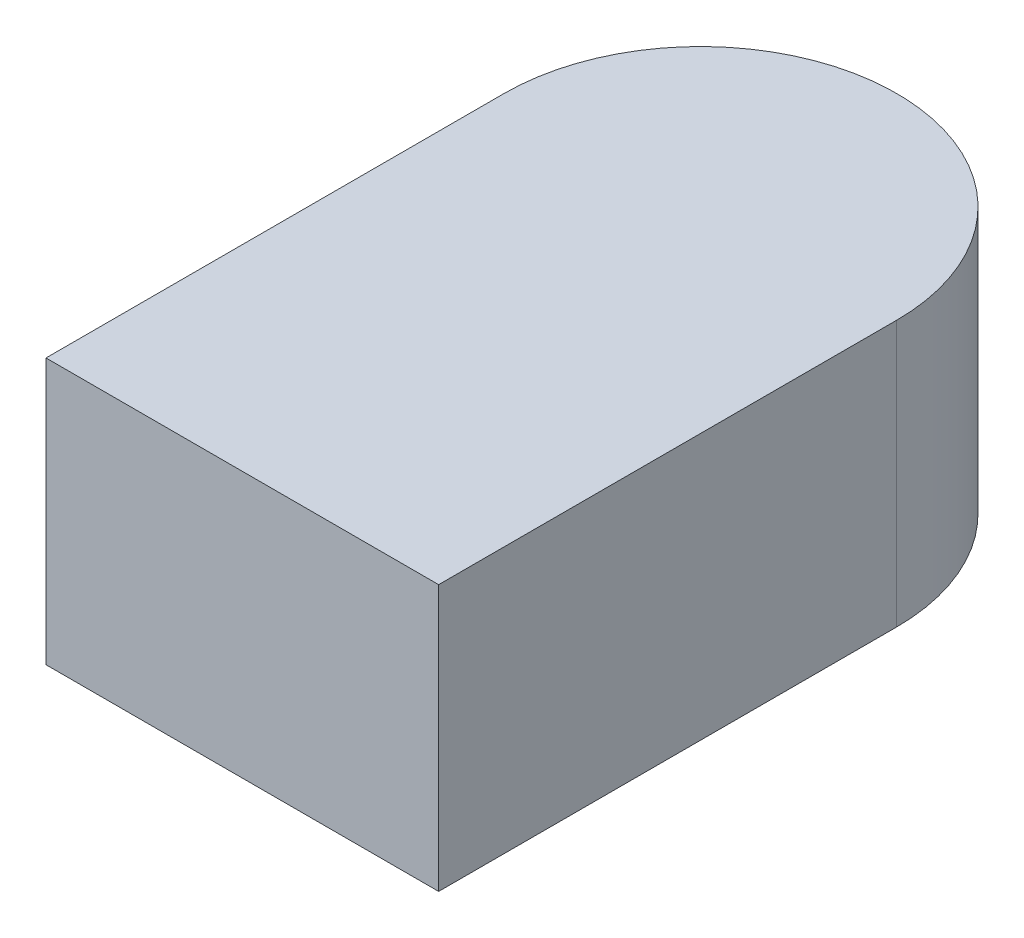
ISO-10303-21;
HEADER;
FILE_DESCRIPTION(('STEP AP214'),'2;1');
FILE_NAME('part.step','',(''),(''),'','','');
FILE_SCHEMA(('AUTOMOTIVE_DESIGN { 1 0 10303 214 1 1 1 1 }'));
ENDSEC;
DATA;
#1=APPLICATION_CONTEXT('core data for automotive mechanical design processes');
#2=APPLICATION_PROTOCOL_DEFINITION('international standard','automotive_design',2000,#1);
#3=PRODUCT_CONTEXT('',#1,'mechanical');
#4=PRODUCT('Part','Part','',(#3));
#5=PRODUCT_RELATED_PRODUCT_CATEGORY('part','',(#4));
#6=PRODUCT_DEFINITION_FORMATION('','',#4);
#7=PRODUCT_DEFINITION_CONTEXT('part definition',#1,'design');
#8=PRODUCT_DEFINITION('design','',#6,#7);
#9=PRODUCT_DEFINITION_SHAPE('','',#8);
#10=(LENGTH_UNIT() NAMED_UNIT(*) SI_UNIT(.MILLI.,.METRE.));
#11=(NAMED_UNIT(*) PLANE_ANGLE_UNIT() SI_UNIT($,.RADIAN.));
#12=(NAMED_UNIT(*) SI_UNIT($,.STERADIAN.) SOLID_ANGLE_UNIT());
#13=UNCERTAINTY_MEASURE_WITH_UNIT(LENGTH_MEASURE(1.E-05),#10,'distance_accuracy_value','');
#14=(GEOMETRIC_REPRESENTATION_CONTEXT(3) GLOBAL_UNCERTAINTY_ASSIGNED_CONTEXT((#13)) GLOBAL_UNIT_ASSIGNED_CONTEXT((#10,
#11,#12)) REPRESENTATION_CONTEXT('',''));
#15=CARTESIAN_POINT('',(0.,0.,0.));
#16=DIRECTION('',(0.,0.,1.));
#17=DIRECTION('',(1.,0.,0.));
#18=AXIS2_PLACEMENT_3D('',#15,#16,#17);
#19=CARTESIAN_POINT('',(0.15,0.203,-0.175));
#20=DIRECTION('',(-1.,0.,0.));
#21=DIRECTION('',(0.,0.,1.));
#22=AXIS2_PLACEMENT_3D('',#19,#20,#21);
#23=PLANE('',#22);
#24=DIRECTION('',(0.,0.,-1.));
#25=VECTOR('',#24,1.);
#26=CARTESIAN_POINT('',(0.15,0.,-0.175));
#27=LINE('',#26,#25);
#28=CARTESIAN_POINT('',(0.15,0.,0.175));
#29=VERTEX_POINT('',#28);
#30=CARTESIAN_POINT('',(0.15,0.,-0.175));
#31=VERTEX_POINT('',#30);
#32=EDGE_CURVE('E106',#29,#31,#27,.T.);
#33=ORIENTED_EDGE('',*,*,#32,.T.);
#34=DIRECTION('',(0.,-1.,0.));
#35=VECTOR('',#34,1.);
#36=CARTESIAN_POINT('',(0.15,0.203,-0.175));
#37=LINE('',#36,#35);
#38=CARTESIAN_POINT('',(0.15,0.203,-0.175));
#39=VERTEX_POINT('',#38);
#40=EDGE_CURVE('E11',#39,#31,#37,.T.);
#41=ORIENTED_EDGE('',*,*,#40,.F.);
#42=DIRECTION('',(0.,0.,-1.));
#43=VECTOR('',#42,1.);
#44=CARTESIAN_POINT('',(0.15,0.203,-0.175));
#45=LINE('',#44,#43);
#46=CARTESIAN_POINT('',(0.15,0.203,0.175));
#47=VERTEX_POINT('',#46);
#48=EDGE_CURVE('E88',#47,#39,#45,.T.);
#49=ORIENTED_EDGE('',*,*,#48,.F.);
#50=DIRECTION('',(0.,-1.,0.));
#51=VECTOR('',#50,1.);
#52=CARTESIAN_POINT('',(0.15,0.203,0.175));
#53=LINE('',#52,#51);
#54=EDGE_CURVE('E102',#47,#29,#53,.T.);
#55=ORIENTED_EDGE('',*,*,#54,.T.);
#56=EDGE_LOOP('',(#33,#41,#49,#55));
#57=FACE_BOUND('',#56,.T.);
#58=ADVANCED_FACE('F36',(#57),#23,.F.);
#59=CARTESIAN_POINT('',(0.,0.203,-0.175));
#60=DIRECTION('',(0.,-1.,0.));
#61=DIRECTION('',(0.,0.,-1.));
#62=AXIS2_PLACEMENT_3D('',#59,#60,#61);
#63=CYLINDRICAL_SURFACE('',#62,0.15);
#64=CARTESIAN_POINT('',(0.,0.,-0.175));
#65=DIRECTION('',(0.,1.,0.));
#66=DIRECTION('',(0.,0.,1.));
#67=AXIS2_PLACEMENT_3D('',#64,#65,#66);
#68=CIRCLE('',#67,0.15);
#69=CARTESIAN_POINT('',(-0.15,0.,-0.175));
#70=VERTEX_POINT('',#69);
#71=EDGE_CURVE('E93',#31,#70,#68,.T.);
#72=ORIENTED_EDGE('',*,*,#71,.T.);
#73=DIRECTION('',(0.,-1.,0.));
#74=VECTOR('',#73,1.);
#75=CARTESIAN_POINT('',(-0.15,0.203,-0.175));
#76=LINE('',#75,#74);
#77=CARTESIAN_POINT('',(-0.15,0.203,-0.175));
#78=VERTEX_POINT('',#77);
#79=EDGE_CURVE('E45',#78,#70,#76,.T.);
#80=ORIENTED_EDGE('',*,*,#79,.F.);
#81=CARTESIAN_POINT('',(0.,0.203,-0.175));
#82=DIRECTION('',(0.,1.,0.));
#83=DIRECTION('',(0.,0.,1.));
#84=AXIS2_PLACEMENT_3D('',#81,#82,#83);
#85=CIRCLE('',#84,0.15);
#86=EDGE_CURVE('E83',#39,#78,#85,.T.);
#87=ORIENTED_EDGE('',*,*,#86,.F.);
#88=ORIENTED_EDGE('',*,*,#40,.T.);
#89=EDGE_LOOP('',(#72,#80,#87,#88));
#90=FACE_BOUND('',#89,.T.);
#91=ADVANCED_FACE('F92',(#90),#63,.T.);
#92=CARTESIAN_POINT('',(-0.15,0.203,-0.175));
#93=DIRECTION('',(1.,0.,0.));
#94=DIRECTION('',(0.,0.,-1.));
#95=AXIS2_PLACEMENT_3D('',#92,#93,#94);
#96=PLANE('',#95);
#97=DIRECTION('',(0.,0.,1.));
#98=VECTOR('',#97,1.);
#99=CARTESIAN_POINT('',(-0.15,0.,-0.175));
#100=LINE('',#99,#98);
#101=CARTESIAN_POINT('',(-0.15,0.,0.175));
#102=VERTEX_POINT('',#101);
#103=EDGE_CURVE('E70',#70,#102,#100,.T.);
#104=ORIENTED_EDGE('',*,*,#103,.T.);
#105=DIRECTION('',(0.,-1.,0.));
#106=VECTOR('',#105,1.);
#107=CARTESIAN_POINT('',(-0.15,0.203,0.175));
#108=LINE('',#107,#106);
#109=CARTESIAN_POINT('',(-0.15,0.203,0.175));
#110=VERTEX_POINT('',#109);
#111=EDGE_CURVE('E95',#110,#102,#108,.T.);
#112=ORIENTED_EDGE('',*,*,#111,.F.);
#113=DIRECTION('',(0.,0.,1.));
#114=VECTOR('',#113,1.);
#115=CARTESIAN_POINT('',(-0.15,0.203,-0.175));
#116=LINE('',#115,#114);
#117=EDGE_CURVE('E86',#78,#110,#116,.T.);
#118=ORIENTED_EDGE('',*,*,#117,.F.);
#119=ORIENTED_EDGE('',*,*,#79,.T.);
#120=EDGE_LOOP('',(#104,#112,#118,#119));
#121=FACE_BOUND('',#120,.T.);
#122=ADVANCED_FACE('F96',(#121),#96,.F.);
#123=CARTESIAN_POINT('',(-0.15,0.203,0.175));
#124=DIRECTION('',(0.,0.,-1.));
#125=DIRECTION('',(-1.,0.,0.));
#126=AXIS2_PLACEMENT_3D('',#123,#124,#125);
#127=PLANE('',#126);
#128=DIRECTION('',(1.,0.,0.));
#129=VECTOR('',#128,1.);
#130=CARTESIAN_POINT('',(-0.15,0.,0.175));
#131=LINE('',#130,#129);
#132=EDGE_CURVE('E76',#102,#29,#131,.T.);
#133=ORIENTED_EDGE('',*,*,#132,.T.);
#134=ORIENTED_EDGE('',*,*,#54,.F.);
#135=DIRECTION('',(1.,0.,0.));
#136=VECTOR('',#135,1.);
#137=CARTESIAN_POINT('',(-0.15,0.203,0.175));
#138=LINE('',#137,#136);
#139=EDGE_CURVE('E53',#110,#47,#138,.T.);
#140=ORIENTED_EDGE('',*,*,#139,.F.);
#141=ORIENTED_EDGE('',*,*,#111,.T.);
#142=EDGE_LOOP('',(#133,#134,#140,#141));
#143=FACE_BOUND('',#142,.T.);
#144=ADVANCED_FACE('F117',(#143),#127,.F.);
#145=CARTESIAN_POINT('',(0.,0.203,-0.175));
#146=DIRECTION('',(0.,1.,0.));
#147=DIRECTION('',(0.,0.,1.));
#148=AXIS2_PLACEMENT_3D('',#145,#146,#147);
#149=PLANE('',#148);
#150=ORIENTED_EDGE('',*,*,#48,.T.);
#151=ORIENTED_EDGE('',*,*,#86,.T.);
#152=ORIENTED_EDGE('',*,*,#117,.T.);
#153=ORIENTED_EDGE('',*,*,#139,.T.);
#154=EDGE_LOOP('',(#150,#151,#152,#153));
#155=FACE_BOUND('',#154,.T.);
#156=ADVANCED_FACE('F84',(#155),#149,.T.);
#157=CARTESIAN_POINT('',(0.,0.,-0.175));
#158=DIRECTION('',(0.,1.,0.));
#159=DIRECTION('',(0.,0.,1.));
#160=AXIS2_PLACEMENT_3D('',#157,#158,#159);
#161=PLANE('',#160);
#162=ORIENTED_EDGE('',*,*,#32,.F.);
#163=ORIENTED_EDGE('',*,*,#132,.F.);
#164=ORIENTED_EDGE('',*,*,#103,.F.);
#165=ORIENTED_EDGE('',*,*,#71,.F.);
#166=EDGE_LOOP('',(#162,#163,#164,#165));
#167=FACE_BOUND('',#166,.T.);
#168=ADVANCED_FACE('F120',(#167),#161,.F.);
#169=CLOSED_SHELL('',(#58,#91,#122,#144,#156,#168));
#170=MANIFOLD_SOLID_BREP('B2',#169);
#171=ADVANCED_BREP_SHAPE_REPRESENTATION('',(#18,#170),#14);
#172=SHAPE_DEFINITION_REPRESENTATION(#9,#171);
ENDSEC;
END-ISO-10303-21;
